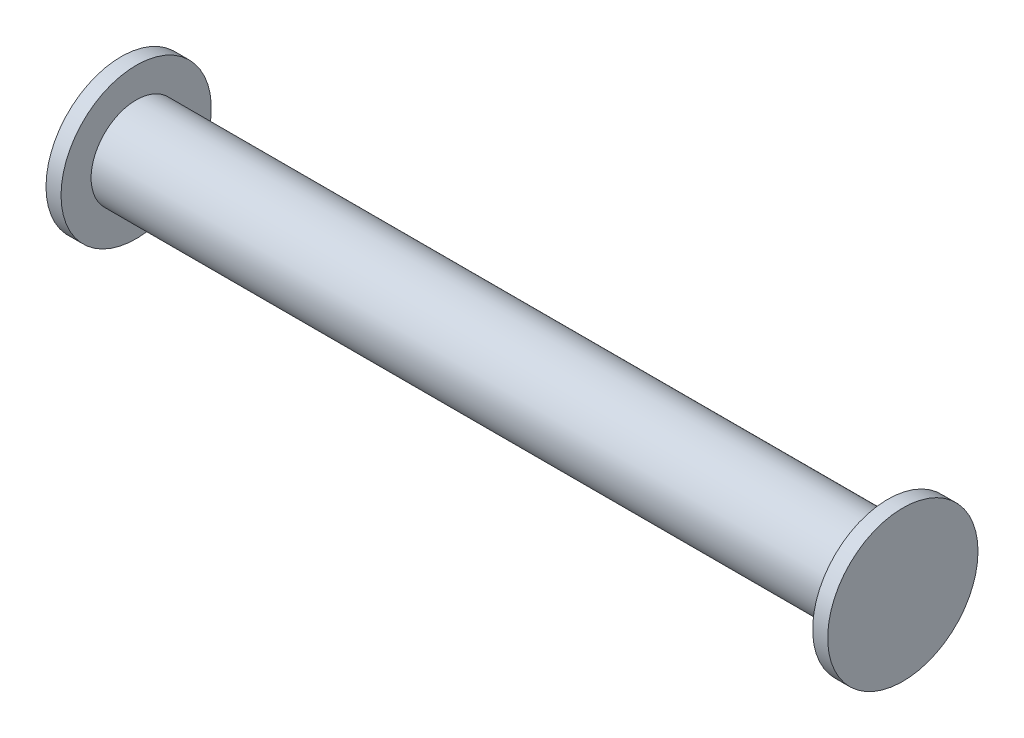
ISO-10303-21;
HEADER;
FILE_DESCRIPTION(('STEP AP214'),'2;1');
FILE_NAME('part.step','',(''),(''),'','','');
FILE_SCHEMA(('AUTOMOTIVE_DESIGN { 1 0 10303 214 1 1 1 1 }'));
ENDSEC;
DATA;
#1=APPLICATION_CONTEXT('core data for automotive mechanical design processes');
#2=APPLICATION_PROTOCOL_DEFINITION('international standard','automotive_design',2000,#1);
#3=PRODUCT_CONTEXT('',#1,'mechanical');
#4=PRODUCT('Part','Part','',(#3));
#5=PRODUCT_RELATED_PRODUCT_CATEGORY('part','',(#4));
#6=PRODUCT_DEFINITION_FORMATION('','',#4);
#7=PRODUCT_DEFINITION_CONTEXT('part definition',#1,'design');
#8=PRODUCT_DEFINITION('design','',#6,#7);
#9=PRODUCT_DEFINITION_SHAPE('','',#8);
#10=(LENGTH_UNIT() NAMED_UNIT(*) SI_UNIT(.MILLI.,.METRE.));
#11=(NAMED_UNIT(*) PLANE_ANGLE_UNIT() SI_UNIT($,.RADIAN.));
#12=(NAMED_UNIT(*) SI_UNIT($,.STERADIAN.) SOLID_ANGLE_UNIT());
#13=UNCERTAINTY_MEASURE_WITH_UNIT(LENGTH_MEASURE(1.E-05),#10,'distance_accuracy_value','');
#14=(GEOMETRIC_REPRESENTATION_CONTEXT(3) GLOBAL_UNCERTAINTY_ASSIGNED_CONTEXT((#13)) GLOBAL_UNIT_ASSIGNED_CONTEXT((#10,
#11,#12)) REPRESENTATION_CONTEXT('',''));
#15=CARTESIAN_POINT('',(0.,0.,0.));
#16=DIRECTION('',(0.,0.,1.));
#17=DIRECTION('',(1.,0.,0.));
#18=AXIS2_PLACEMENT_3D('',#15,#16,#17);
#19=CARTESIAN_POINT('',(52.,0.,0.));
#20=DIRECTION('',(-1.,0.,0.));
#21=DIRECTION('',(0.,0.,1.));
#22=AXIS2_PLACEMENT_3D('',#19,#20,#21);
#23=CYLINDRICAL_SURFACE('',#22,10.);
#24=CARTESIAN_POINT('',(52.,0.,0.));
#25=DIRECTION('',(1.,0.,0.));
#26=DIRECTION('',(0.,0.,-1.));
#27=AXIS2_PLACEMENT_3D('',#24,#25,#26);
#28=CIRCLE('',#27,10.);
#29=CARTESIAN_POINT('',(52.,0.,-10.));
#30=VERTEX_POINT('',#29);
#31=EDGE_CURVE('E11',#30,#30,#28,.T.);
#32=ORIENTED_EDGE('',*,*,#31,.F.);
#33=EDGE_LOOP('',(#32));
#34=FACE_BOUND('',#33,.T.);
#35=CARTESIAN_POINT('',(50.,0.,0.));
#36=DIRECTION('',(1.,0.,0.));
#37=DIRECTION('',(0.,0.,-1.));
#38=AXIS2_PLACEMENT_3D('',#35,#36,#37);
#39=CIRCLE('',#38,10.);
#40=CARTESIAN_POINT('',(50.,0.,-10.));
#41=VERTEX_POINT('',#40);
#42=EDGE_CURVE('E53',#41,#41,#39,.T.);
#43=ORIENTED_EDGE('',*,*,#42,.T.);
#44=EDGE_LOOP('',(#43));
#45=FACE_BOUND('',#44,.T.);
#46=ADVANCED_FACE('F50',(#34,#45),#23,.T.);
#47=CARTESIAN_POINT('',(52.,0.,0.));
#48=DIRECTION('',(1.,0.,0.));
#49=DIRECTION('',(0.,0.,-1.));
#50=AXIS2_PLACEMENT_3D('',#47,#48,#49);
#51=PLANE('',#50);
#52=ORIENTED_EDGE('',*,*,#31,.T.);
#53=EDGE_LOOP('',(#52));
#54=FACE_BOUND('',#53,.T.);
#55=ADVANCED_FACE('F67',(#54),#51,.T.);
#56=CARTESIAN_POINT('',(50.,0.,0.));
#57=DIRECTION('',(1.,0.,0.));
#58=DIRECTION('',(0.,0.,-1.));
#59=AXIS2_PLACEMENT_3D('',#56,#57,#58);
#60=PLANE('',#59);
#61=ORIENTED_EDGE('',*,*,#42,.F.);
#62=EDGE_LOOP('',(#61));
#63=FACE_BOUND('',#62,.T.);
#64=ADVANCED_FACE('F65',(#63),#60,.F.);
#65=CLOSED_SHELL('',(#46,#55,#64));
#66=MANIFOLD_SOLID_BREP('B2',#65);
#67=CARTESIAN_POINT('',(-52.,0.,0.));
#68=DIRECTION('',(1.,0.,0.));
#69=DIRECTION('',(0.,0.,-1.));
#70=AXIS2_PLACEMENT_3D('',#67,#68,#69);
#71=CYLINDRICAL_SURFACE('',#70,10.);
#72=CARTESIAN_POINT('',(-52.,0.,0.));
#73=DIRECTION('',(-1.,0.,0.));
#74=DIRECTION('',(0.,0.,1.));
#75=AXIS2_PLACEMENT_3D('',#72,#73,#74);
#76=CIRCLE('',#75,10.);
#77=CARTESIAN_POINT('',(-52.,0.,10.));
#78=VERTEX_POINT('',#77);
#79=EDGE_CURVE('E49',#78,#78,#76,.T.);
#80=ORIENTED_EDGE('',*,*,#79,.F.);
#81=EDGE_LOOP('',(#80));
#82=FACE_BOUND('',#81,.T.);
#83=CARTESIAN_POINT('',(-50.,0.,0.));
#84=DIRECTION('',(-1.,0.,0.));
#85=DIRECTION('',(0.,0.,1.));
#86=AXIS2_PLACEMENT_3D('',#83,#84,#85);
#87=CIRCLE('',#86,10.);
#88=CARTESIAN_POINT('',(-50.,0.,10.));
#89=VERTEX_POINT('',#88);
#90=EDGE_CURVE('E109',#89,#89,#87,.T.);
#91=ORIENTED_EDGE('',*,*,#90,.T.);
#92=EDGE_LOOP('',(#91));
#93=FACE_BOUND('',#92,.T.);
#94=ADVANCED_FACE('F106',(#82,#93),#71,.T.);
#95=CARTESIAN_POINT('',(-52.,0.,0.));
#96=DIRECTION('',(-1.,0.,0.));
#97=DIRECTION('',(0.,0.,1.));
#98=AXIS2_PLACEMENT_3D('',#95,#96,#97);
#99=PLANE('',#98);
#100=ORIENTED_EDGE('',*,*,#79,.T.);
#101=EDGE_LOOP('',(#100));
#102=FACE_BOUND('',#101,.T.);
#103=ADVANCED_FACE('F123',(#102),#99,.T.);
#104=CARTESIAN_POINT('',(-50.,0.,0.));
#105=DIRECTION('',(-1.,0.,0.));
#106=DIRECTION('',(0.,0.,1.));
#107=AXIS2_PLACEMENT_3D('',#104,#105,#106);
#108=PLANE('',#107);
#109=ORIENTED_EDGE('',*,*,#90,.F.);
#110=EDGE_LOOP('',(#109));
#111=FACE_BOUND('',#110,.T.);
#112=ADVANCED_FACE('F121',(#111),#108,.F.);
#113=CLOSED_SHELL('',(#94,#103,#112));
#114=MANIFOLD_SOLID_BREP('B6',#113);
#115=CARTESIAN_POINT('',(50.,0.,0.));
#116=DIRECTION('',(1.,0.,0.));
#117=DIRECTION('',(0.,0.,-1.));
#118=AXIS2_PLACEMENT_3D('',#115,#116,#117);
#119=PLANE('',#118);
#120=CARTESIAN_POINT('',(50.,0.,0.));
#121=DIRECTION('',(1.,0.,0.));
#122=DIRECTION('',(0.,0.,-1.));
#123=AXIS2_PLACEMENT_3D('',#120,#121,#122);
#124=CIRCLE('',#123,6.);
#125=CARTESIAN_POINT('',(50.,0.,-6.));
#126=VERTEX_POINT('',#125);
#127=EDGE_CURVE('E105',#126,#126,#124,.T.);
#128=ORIENTED_EDGE('',*,*,#127,.T.);
#129=EDGE_LOOP('',(#128));
#130=FACE_BOUND('',#129,.T.);
#131=CARTESIAN_POINT('',(50.,0.,0.));
#132=DIRECTION('',(1.,0.,0.));
#133=DIRECTION('',(0.,0.,-1.));
#134=AXIS2_PLACEMENT_3D('',#131,#132,#133);
#135=CIRCLE('',#134,5.);
#136=CARTESIAN_POINT('',(50.,0.,-5.));
#137=VERTEX_POINT('',#136);
#138=EDGE_CURVE('E166',#137,#137,#135,.T.);
#139=ORIENTED_EDGE('',*,*,#138,.F.);
#140=EDGE_LOOP('',(#139));
#141=FACE_BOUND('',#140,.T.);
#142=ADVANCED_FACE('F153',(#130,#141),#119,.T.);
#143=CARTESIAN_POINT('',(-50.,0.,0.));
#144=DIRECTION('',(1.,0.,0.));
#145=DIRECTION('',(0.,0.,-1.));
#146=AXIS2_PLACEMENT_3D('',#143,#144,#145);
#147=PLANE('',#146);
#148=CARTESIAN_POINT('',(-50.,0.,0.));
#149=DIRECTION('',(1.,0.,0.));
#150=DIRECTION('',(0.,0.,-1.));
#151=AXIS2_PLACEMENT_3D('',#148,#149,#150);
#152=CIRCLE('',#151,6.);
#153=CARTESIAN_POINT('',(-50.,0.,-6.));
#154=VERTEX_POINT('',#153);
#155=EDGE_CURVE('E157',#154,#154,#152,.T.);
#156=ORIENTED_EDGE('',*,*,#155,.F.);
#157=EDGE_LOOP('',(#156));
#158=FACE_BOUND('',#157,.T.);
#159=CARTESIAN_POINT('',(-50.,0.,0.));
#160=DIRECTION('',(1.,0.,0.));
#161=DIRECTION('',(0.,0.,-1.));
#162=AXIS2_PLACEMENT_3D('',#159,#160,#161);
#163=CIRCLE('',#162,5.);
#164=CARTESIAN_POINT('',(-50.,0.,-5.));
#165=VERTEX_POINT('',#164);
#166=EDGE_CURVE('E168',#165,#165,#163,.T.);
#167=ORIENTED_EDGE('',*,*,#166,.T.);
#168=EDGE_LOOP('',(#167));
#169=FACE_BOUND('',#168,.T.);
#170=ADVANCED_FACE('F180',(#158,#169),#147,.F.);
#171=CARTESIAN_POINT('',(50.,0.,0.));
#172=DIRECTION('',(-1.,0.,0.));
#173=DIRECTION('',(0.,0.,1.));
#174=AXIS2_PLACEMENT_3D('',#171,#172,#173);
#175=CYLINDRICAL_SURFACE('',#174,6.);
#176=ORIENTED_EDGE('',*,*,#127,.F.);
#177=EDGE_LOOP('',(#176));
#178=FACE_BOUND('',#177,.T.);
#179=ORIENTED_EDGE('',*,*,#155,.T.);
#180=EDGE_LOOP('',(#179));
#181=FACE_BOUND('',#180,.T.);
#182=ADVANCED_FACE('F155',(#178,#181),#175,.T.);
#183=CARTESIAN_POINT('',(50.,0.,0.));
#184=DIRECTION('',(-1.,0.,0.));
#185=DIRECTION('',(0.,0.,1.));
#186=AXIS2_PLACEMENT_3D('',#183,#184,#185);
#187=CYLINDRICAL_SURFACE('',#186,5.);
#188=ORIENTED_EDGE('',*,*,#138,.T.);
#189=EDGE_LOOP('',(#188));
#190=FACE_BOUND('',#189,.T.);
#191=ORIENTED_EDGE('',*,*,#166,.F.);
#192=EDGE_LOOP('',(#191));
#193=FACE_BOUND('',#192,.T.);
#194=ADVANCED_FACE('F176',(#190,#193),#187,.F.);
#195=CLOSED_SHELL('',(#142,#170,#182,#194));
#196=MANIFOLD_SOLID_BREP('B44_NOT_SHOWN',#195);
#197=ADVANCED_BREP_SHAPE_REPRESENTATION('',(#18,#66,#114,#196),#14);
#198=SHAPE_DEFINITION_REPRESENTATION(#9,#197);
ENDSEC;
END-ISO-10303-21;
